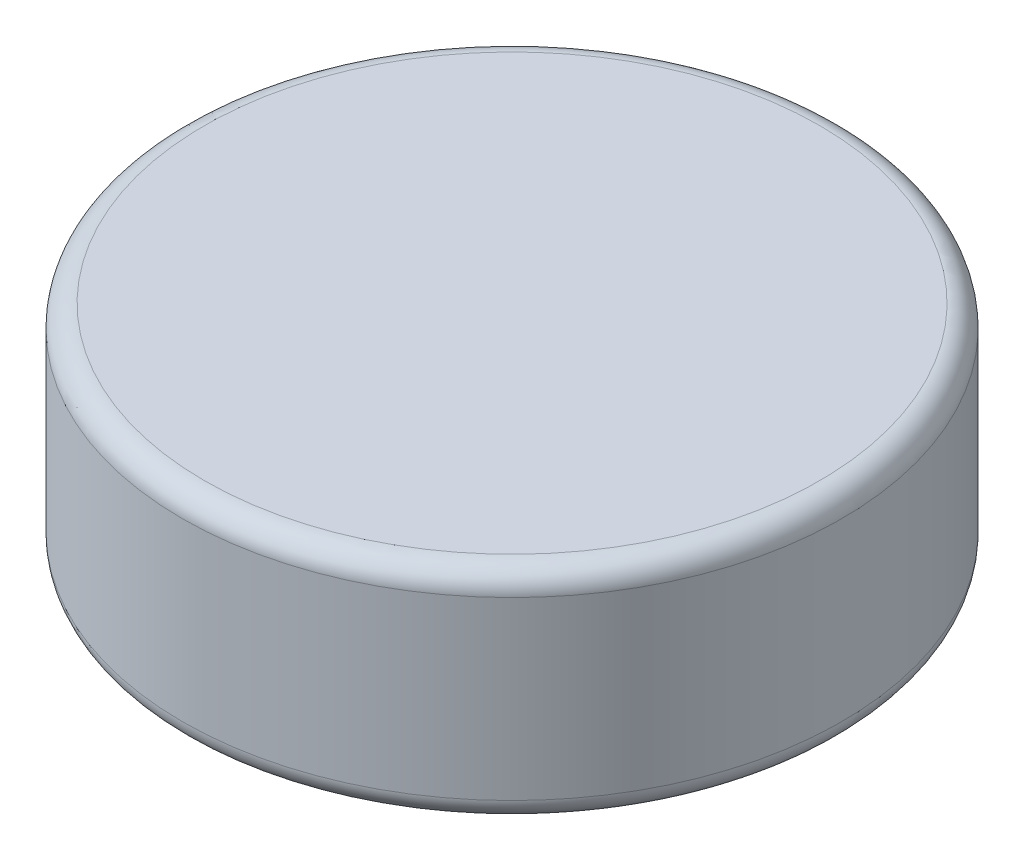
ISO-10303-21;
HEADER;
FILE_DESCRIPTION(('STEP AP214'),'2;1');
FILE_NAME('part.step','',(''),(''),'','','');
FILE_SCHEMA(('AUTOMOTIVE_DESIGN { 1 0 10303 214 1 1 1 1 }'));
ENDSEC;
DATA;
#1=APPLICATION_CONTEXT('core data for automotive mechanical design processes');
#2=APPLICATION_PROTOCOL_DEFINITION('international standard','automotive_design',2000,#1);
#3=PRODUCT_CONTEXT('',#1,'mechanical');
#4=PRODUCT('Part','Part','',(#3));
#5=PRODUCT_RELATED_PRODUCT_CATEGORY('part','',(#4));
#6=PRODUCT_DEFINITION_FORMATION('','',#4);
#7=PRODUCT_DEFINITION_CONTEXT('part definition',#1,'design');
#8=PRODUCT_DEFINITION('design','',#6,#7);
#9=PRODUCT_DEFINITION_SHAPE('','',#8);
#10=(LENGTH_UNIT() NAMED_UNIT(*) SI_UNIT(.MILLI.,.METRE.));
#11=(NAMED_UNIT(*) PLANE_ANGLE_UNIT() SI_UNIT($,.RADIAN.));
#12=(NAMED_UNIT(*) SI_UNIT($,.STERADIAN.) SOLID_ANGLE_UNIT());
#13=UNCERTAINTY_MEASURE_WITH_UNIT(LENGTH_MEASURE(1.E-05),#10,'distance_accuracy_value','');
#14=(GEOMETRIC_REPRESENTATION_CONTEXT(3) GLOBAL_UNCERTAINTY_ASSIGNED_CONTEXT((#13)) GLOBAL_UNIT_ASSIGNED_CONTEXT((#10,
#11,#12)) REPRESENTATION_CONTEXT('',''));
#15=CARTESIAN_POINT('',(0.,0.,0.));
#16=DIRECTION('',(0.,0.,1.));
#17=DIRECTION('',(1.,0.,0.));
#18=AXIS2_PLACEMENT_3D('',#15,#16,#17);
#19=CARTESIAN_POINT('',(0.,2.,0.));
#20=DIRECTION('',(0.,-1.,0.));
#21=DIRECTION('',(0.,0.,-1.));
#22=AXIS2_PLACEMENT_3D('',#19,#20,#21);
#23=CYLINDRICAL_SURFACE('',#22,3.);
#24=CARTESIAN_POINT('',(0.,0.2,0.));
#25=DIRECTION('',(0.,1.,0.));
#26=DIRECTION('',(0.,0.,1.));
#27=AXIS2_PLACEMENT_3D('',#24,#25,#26);
#28=CIRCLE('',#27,3.);
#29=CARTESIAN_POINT('',(0.,0.2,3.));
#30=VERTEX_POINT('',#29);
#31=EDGE_CURVE('E44',#30,#30,#28,.T.);
#32=ORIENTED_EDGE('',*,*,#31,.T.);
#33=EDGE_LOOP('',(#32));
#34=FACE_BOUND('',#33,.T.);
#35=CARTESIAN_POINT('',(0.,1.8,0.));
#36=DIRECTION('',(0.,1.,0.));
#37=DIRECTION('',(0.,0.,1.));
#38=AXIS2_PLACEMENT_3D('',#35,#36,#37);
#39=CIRCLE('',#38,3.);
#40=CARTESIAN_POINT('',(0.,1.8,3.));
#41=VERTEX_POINT('',#40);
#42=EDGE_CURVE('E48',#41,#41,#39,.F.);
#43=ORIENTED_EDGE('',*,*,#42,.T.);
#44=EDGE_LOOP('',(#43));
#45=FACE_BOUND('',#44,.T.);
#46=ADVANCED_FACE('F33',(#34,#45),#23,.T.);
#47=CARTESIAN_POINT('',(0.,2.,0.));
#48=DIRECTION('',(0.,1.,0.));
#49=DIRECTION('',(0.,0.,1.));
#50=AXIS2_PLACEMENT_3D('',#47,#48,#49);
#51=PLANE('',#50);
#52=CARTESIAN_POINT('',(0.,2.,0.));
#53=DIRECTION('',(0.,1.,0.));
#54=DIRECTION('',(0.,0.,1.));
#55=AXIS2_PLACEMENT_3D('',#52,#53,#54);
#56=CIRCLE('',#55,2.8);
#57=CARTESIAN_POINT('',(0.,2.,2.8));
#58=VERTEX_POINT('',#57);
#59=EDGE_CURVE('E10',#58,#58,#56,.T.);
#60=ORIENTED_EDGE('',*,*,#59,.T.);
#61=EDGE_LOOP('',(#60));
#62=FACE_BOUND('',#61,.T.);
#63=ADVANCED_FACE('F64',(#62),#51,.T.);
#64=CARTESIAN_POINT('',(0.,0.,0.));
#65=DIRECTION('',(0.,1.,0.));
#66=DIRECTION('',(0.,0.,1.));
#67=AXIS2_PLACEMENT_3D('',#64,#65,#66);
#68=PLANE('',#67);
#69=CARTESIAN_POINT('',(0.,0.,0.));
#70=DIRECTION('',(0.,1.,0.));
#71=DIRECTION('',(0.,0.,1.));
#72=AXIS2_PLACEMENT_3D('',#69,#70,#71);
#73=CIRCLE('',#72,2.8);
#74=CARTESIAN_POINT('',(0.,0.,2.8));
#75=VERTEX_POINT('',#74);
#76=EDGE_CURVE('E40',#75,#75,#73,.F.);
#77=ORIENTED_EDGE('',*,*,#76,.T.);
#78=EDGE_LOOP('',(#77));
#79=FACE_BOUND('',#78,.T.);
#80=ADVANCED_FACE('F61',(#79),#68,.F.);
#81=CARTESIAN_POINT('',(0.,0.2,0.));
#82=DIRECTION('',(0.,1.,0.));
#83=DIRECTION('',(0.,0.,1.));
#84=AXIS2_PLACEMENT_3D('',#81,#82,#83);
#85=TOROIDAL_SURFACE('',#84,2.8,0.2);
#86=ORIENTED_EDGE('',*,*,#76,.F.);
#87=EDGE_LOOP('',(#86));
#88=FACE_BOUND('',#87,.T.);
#89=ORIENTED_EDGE('',*,*,#31,.F.);
#90=EDGE_LOOP('',(#89));
#91=FACE_BOUND('',#90,.T.);
#92=ADVANCED_FACE('F57',(#88,#91),#85,.T.);
#93=CARTESIAN_POINT('',(0.,1.8,0.));
#94=DIRECTION('',(0.,1.,0.));
#95=DIRECTION('',(0.,0.,1.));
#96=AXIS2_PLACEMENT_3D('',#93,#94,#95);
#97=TOROIDAL_SURFACE('',#96,2.8,0.2);
#98=ORIENTED_EDGE('',*,*,#42,.F.);
#99=EDGE_LOOP('',(#98));
#100=FACE_BOUND('',#99,.T.);
#101=ORIENTED_EDGE('',*,*,#59,.F.);
#102=EDGE_LOOP('',(#101));
#103=FACE_BOUND('',#102,.T.);
#104=ADVANCED_FACE('F35',(#100,#103),#97,.T.);
#105=CLOSED_SHELL('',(#46,#63,#80,#92,#104));
#106=MANIFOLD_SOLID_BREP('B2',#105);
#107=ADVANCED_BREP_SHAPE_REPRESENTATION('',(#18,#106),#14);
#108=SHAPE_DEFINITION_REPRESENTATION(#9,#107);
ENDSEC;
END-ISO-10303-21;
